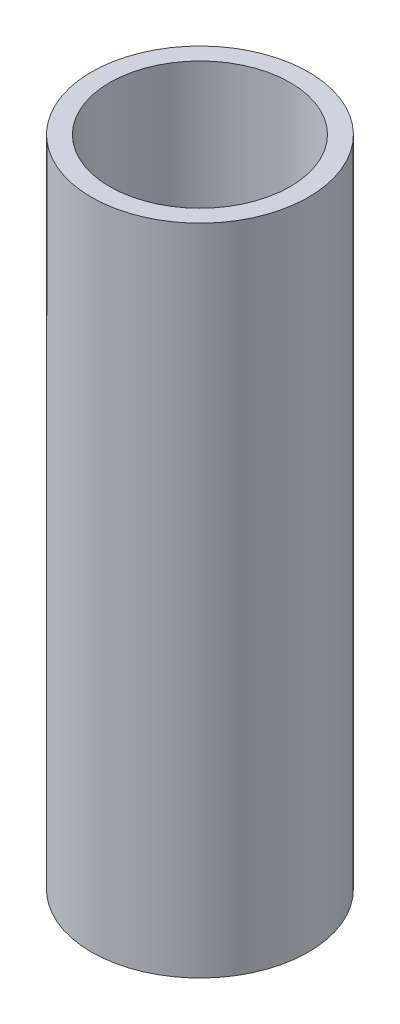
ISO-10303-21;
HEADER;
FILE_DESCRIPTION(('STEP AP214'),'2;1');
FILE_NAME('part.step','',(''),(''),'','','');
FILE_SCHEMA(('AUTOMOTIVE_DESIGN { 1 0 10303 214 1 1 1 1 }'));
ENDSEC;
DATA;
#1=APPLICATION_CONTEXT('core data for automotive mechanical design processes');
#2=APPLICATION_PROTOCOL_DEFINITION('international standard','automotive_design',2000,#1);
#3=PRODUCT_CONTEXT('',#1,'mechanical');
#4=PRODUCT('Part','Part','',(#3));
#5=PRODUCT_RELATED_PRODUCT_CATEGORY('part','',(#4));
#6=PRODUCT_DEFINITION_FORMATION('','',#4);
#7=PRODUCT_DEFINITION_CONTEXT('part definition',#1,'design');
#8=PRODUCT_DEFINITION('design','',#6,#7);
#9=PRODUCT_DEFINITION_SHAPE('','',#8);
#10=(LENGTH_UNIT() NAMED_UNIT(*) SI_UNIT(.MILLI.,.METRE.));
#11=(NAMED_UNIT(*) PLANE_ANGLE_UNIT() SI_UNIT($,.RADIAN.));
#12=(NAMED_UNIT(*) SI_UNIT($,.STERADIAN.) SOLID_ANGLE_UNIT());
#13=UNCERTAINTY_MEASURE_WITH_UNIT(LENGTH_MEASURE(1.E-05),#10,'distance_accuracy_value','');
#14=(GEOMETRIC_REPRESENTATION_CONTEXT(3) GLOBAL_UNCERTAINTY_ASSIGNED_CONTEXT((#13)) GLOBAL_UNIT_ASSIGNED_CONTEXT((#10,
#11,#12)) REPRESENTATION_CONTEXT('',''));
#15=CARTESIAN_POINT('',(0.,0.,0.));
#16=DIRECTION('',(0.,0.,1.));
#17=DIRECTION('',(1.,0.,0.));
#18=AXIS2_PLACEMENT_3D('',#15,#16,#17);
#19=CARTESIAN_POINT('',(0.,127.,0.));
#20=DIRECTION('',(0.,1.,0.));
#21=DIRECTION('',(0.,0.,1.));
#22=AXIS2_PLACEMENT_3D('',#19,#20,#21);
#23=PLANE('',#22);
#24=CARTESIAN_POINT('',(0.,127.,0.));
#25=DIRECTION('',(0.,1.,0.));
#26=DIRECTION('',(0.,0.,1.));
#27=AXIS2_PLACEMENT_3D('',#24,#25,#26);
#28=CIRCLE('',#27,21.082);
#29=CARTESIAN_POINT('',(0.,127.,21.082));
#30=VERTEX_POINT('',#29);
#31=EDGE_CURVE('E10',#30,#30,#28,.T.);
#32=ORIENTED_EDGE('',*,*,#31,.T.);
#33=EDGE_LOOP('',(#32));
#34=FACE_BOUND('',#33,.T.);
#35=CARTESIAN_POINT('',(0.,127.,0.));
#36=DIRECTION('',(0.,1.,0.));
#37=DIRECTION('',(0.,0.,1.));
#38=AXIS2_PLACEMENT_3D('',#35,#36,#37);
#39=CIRCLE('',#38,17.526);
#40=CARTESIAN_POINT('',(0.,127.,17.526));
#41=VERTEX_POINT('',#40);
#42=EDGE_CURVE('E39',#41,#41,#39,.T.);
#43=ORIENTED_EDGE('',*,*,#42,.F.);
#44=EDGE_LOOP('',(#43));
#45=FACE_BOUND('',#44,.T.);
#46=ADVANCED_FACE('F28',(#34,#45),#23,.T.);
#47=CARTESIAN_POINT('',(0.,0.,0.));
#48=DIRECTION('',(0.,1.,0.));
#49=DIRECTION('',(0.,0.,1.));
#50=AXIS2_PLACEMENT_3D('',#47,#48,#49);
#51=PLANE('',#50);
#52=CARTESIAN_POINT('',(0.,0.,0.));
#53=DIRECTION('',(0.,1.,0.));
#54=DIRECTION('',(0.,0.,1.));
#55=AXIS2_PLACEMENT_3D('',#52,#53,#54);
#56=CIRCLE('',#55,21.082);
#57=CARTESIAN_POINT('',(0.,0.,21.082));
#58=VERTEX_POINT('',#57);
#59=EDGE_CURVE('E32',#58,#58,#56,.T.);
#60=ORIENTED_EDGE('',*,*,#59,.F.);
#61=EDGE_LOOP('',(#60));
#62=FACE_BOUND('',#61,.T.);
#63=CARTESIAN_POINT('',(0.,0.,0.));
#64=DIRECTION('',(0.,1.,0.));
#65=DIRECTION('',(0.,0.,1.));
#66=AXIS2_PLACEMENT_3D('',#63,#64,#65);
#67=CIRCLE('',#66,17.526);
#68=CARTESIAN_POINT('',(0.,0.,17.526));
#69=VERTEX_POINT('',#68);
#70=EDGE_CURVE('E41',#69,#69,#67,.T.);
#71=ORIENTED_EDGE('',*,*,#70,.T.);
#72=EDGE_LOOP('',(#71));
#73=FACE_BOUND('',#72,.T.);
#74=ADVANCED_FACE('F51',(#62,#73),#51,.F.);
#75=CARTESIAN_POINT('',(0.,127.,0.));
#76=DIRECTION('',(0.,-1.,0.));
#77=DIRECTION('',(0.,0.,-1.));
#78=AXIS2_PLACEMENT_3D('',#75,#76,#77);
#79=CYLINDRICAL_SURFACE('',#78,21.082);
#80=ORIENTED_EDGE('',*,*,#31,.F.);
#81=EDGE_LOOP('',(#80));
#82=FACE_BOUND('',#81,.T.);
#83=ORIENTED_EDGE('',*,*,#59,.T.);
#84=EDGE_LOOP('',(#83));
#85=FACE_BOUND('',#84,.T.);
#86=ADVANCED_FACE('F30',(#82,#85),#79,.T.);
#87=CARTESIAN_POINT('',(0.,127.,0.));
#88=DIRECTION('',(0.,-1.,0.));
#89=DIRECTION('',(0.,0.,-1.));
#90=AXIS2_PLACEMENT_3D('',#87,#88,#89);
#91=CYLINDRICAL_SURFACE('',#90,17.526);
#92=ORIENTED_EDGE('',*,*,#42,.T.);
#93=EDGE_LOOP('',(#92));
#94=FACE_BOUND('',#93,.T.);
#95=ORIENTED_EDGE('',*,*,#70,.F.);
#96=EDGE_LOOP('',(#95));
#97=FACE_BOUND('',#96,.T.);
#98=ADVANCED_FACE('F47',(#94,#97),#91,.F.);
#99=CLOSED_SHELL('',(#46,#74,#86,#98));
#100=MANIFOLD_SOLID_BREP('B2',#99);
#101=ADVANCED_BREP_SHAPE_REPRESENTATION('',(#18,#100),#14);
#102=SHAPE_DEFINITION_REPRESENTATION(#9,#101);
ENDSEC;
END-ISO-10303-21;
